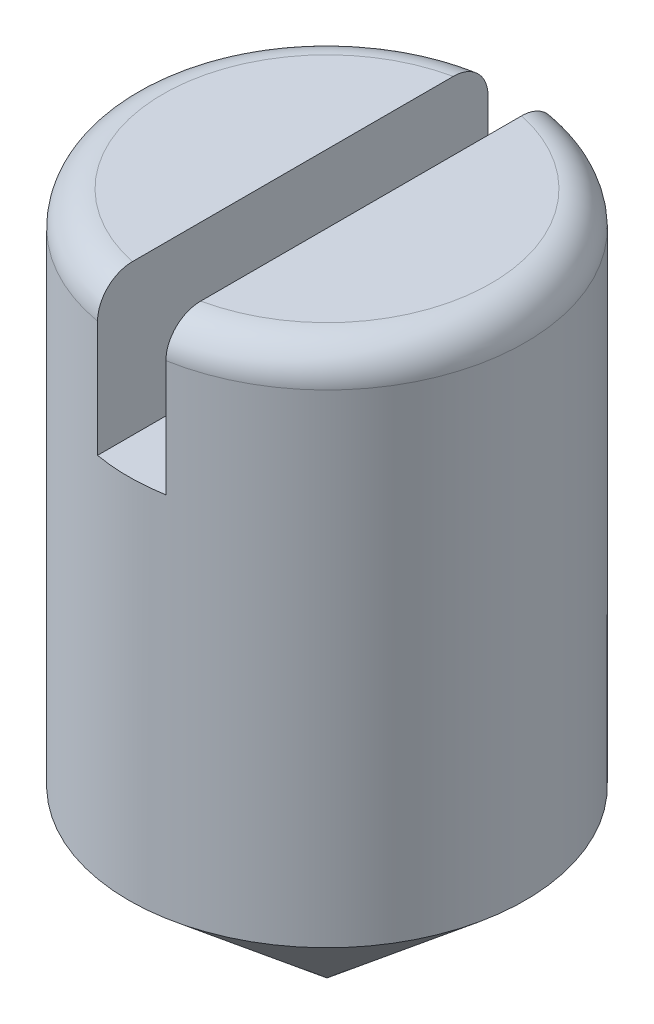
ISO-10303-21;
HEADER;
FILE_DESCRIPTION(('STEP AP214'),'2;1');
FILE_NAME('part.step','',(''),(''),'','','');
FILE_SCHEMA(('AUTOMOTIVE_DESIGN { 1 0 10303 214 1 1 1 1 }'));
ENDSEC;
DATA;
#1=APPLICATION_CONTEXT('core data for automotive mechanical design processes');
#2=APPLICATION_PROTOCOL_DEFINITION('international standard','automotive_design',2000,#1);
#3=PRODUCT_CONTEXT('',#1,'mechanical');
#4=PRODUCT('Part','Part','',(#3));
#5=PRODUCT_RELATED_PRODUCT_CATEGORY('part','',(#4));
#6=PRODUCT_DEFINITION_FORMATION('','',#4);
#7=PRODUCT_DEFINITION_CONTEXT('part definition',#1,'design');
#8=PRODUCT_DEFINITION('design','',#6,#7);
#9=PRODUCT_DEFINITION_SHAPE('','',#8);
#10=(LENGTH_UNIT() NAMED_UNIT(*) SI_UNIT(.MILLI.,.METRE.));
#11=(NAMED_UNIT(*) PLANE_ANGLE_UNIT() SI_UNIT($,.RADIAN.));
#12=(NAMED_UNIT(*) SI_UNIT($,.STERADIAN.) SOLID_ANGLE_UNIT());
#13=UNCERTAINTY_MEASURE_WITH_UNIT(LENGTH_MEASURE(1.E-05),#10,'distance_accuracy_value','');
#14=(GEOMETRIC_REPRESENTATION_CONTEXT(3) GLOBAL_UNCERTAINTY_ASSIGNED_CONTEXT((#13)) GLOBAL_UNIT_ASSIGNED_CONTEXT((#10,
#11,#12)) REPRESENTATION_CONTEXT('',''));
#15=CARTESIAN_POINT('',(0.,0.,0.));
#16=DIRECTION('',(0.,0.,1.));
#17=DIRECTION('',(1.,0.,0.));
#18=AXIS2_PLACEMENT_3D('',#15,#16,#17);
#19=CARTESIAN_POINT('',(0.,5.,0.));
#20=DIRECTION('',(0.,1.,0.));
#21=DIRECTION('',(0.,0.,1.));
#22=AXIS2_PLACEMENT_3D('',#19,#20,#21);
#23=PLANE('',#22);
#24=DIRECTION('',(0.,0.,1.));
#25=VECTOR('',#24,1.);
#26=CARTESIAN_POINT('',(-0.25,5.,-2.));
#27=LINE('',#26,#25);
#28=CARTESIAN_POINT('',(-0.25,5.,-1.17366945943055));
#29=VERTEX_POINT('',#28);
#30=CARTESIAN_POINT('',(-0.25,5.,1.17366945943055));
#31=VERTEX_POINT('',#30);
#32=EDGE_CURVE('E170',#29,#31,#27,.T.);
#33=ORIENTED_EDGE('',*,*,#32,.F.);
#34=CARTESIAN_POINT('',(0.,5.,0.));
#35=DIRECTION('',(0.,1.,0.));
#36=DIRECTION('',(0.,0.,1.));
#37=AXIS2_PLACEMENT_3D('',#34,#35,#36);
#38=CIRCLE('',#37,1.2);
#39=EDGE_CURVE('E11',#29,#31,#38,.T.);
#40=ORIENTED_EDGE('',*,*,#39,.T.);
#41=EDGE_LOOP('',(#33,#40));
#42=FACE_BOUND('',#41,.T.);
#43=ADVANCED_FACE('F32',(#42),#23,.T.);
#44=DIRECTION('',(0.,0.,1.));
#45=VECTOR('',#44,1.);
#46=CARTESIAN_POINT('',(0.25,5.,-2.));
#47=LINE('',#46,#45);
#48=CARTESIAN_POINT('',(0.25,5.,-1.17366945943055));
#49=VERTEX_POINT('',#48);
#50=CARTESIAN_POINT('',(0.25,5.,1.17366945943055));
#51=VERTEX_POINT('',#50);
#52=EDGE_CURVE('E164',#49,#51,#47,.T.);
#53=ORIENTED_EDGE('',*,*,#52,.T.);
#54=CARTESIAN_POINT('',(0.,5.,0.));
#55=DIRECTION('',(0.,1.,0.));
#56=DIRECTION('',(0.,0.,1.));
#57=AXIS2_PLACEMENT_3D('',#54,#55,#56);
#58=CIRCLE('',#57,1.2);
#59=EDGE_CURVE('E158',#51,#49,#58,.T.);
#60=ORIENTED_EDGE('',*,*,#59,.T.);
#61=EDGE_LOOP('',(#53,#60));
#62=FACE_BOUND('',#61,.T.);
#63=ADVANCED_FACE('F169',(#62),#23,.T.);
#64=CARTESIAN_POINT('',(0.,-16.3291243580724,0.));
#65=DIRECTION('',(0.,-1.,0.));
#66=DIRECTION('',(0.,0.,-1.));
#67=AXIS2_PLACEMENT_3D('',#64,#65,#66);
#68=CYLINDRICAL_SURFACE('',#67,1.45);
#69=DIRECTION('',(0.,-1.,0.));
#70=VECTOR('',#69,1.);
#71=CARTESIAN_POINT('',(0.250000000000004,-16.3291243580724,-1.42828568570857));
#72=LINE('',#71,#70);
#73=CARTESIAN_POINT('',(0.250000000000004,4.75,-1.42828568570857));
#74=VERTEX_POINT('',#73);
#75=CARTESIAN_POINT('',(0.25,3.9,-1.42828568570857));
#76=VERTEX_POINT('',#75);
#77=EDGE_CURVE('E97',#74,#76,#72,.T.);
#78=ORIENTED_EDGE('',*,*,#77,.F.);
#79=CARTESIAN_POINT('',(0.,4.75,0.));
#80=DIRECTION('',(0.,1.,0.));
#81=DIRECTION('',(0.,0.,1.));
#82=AXIS2_PLACEMENT_3D('',#79,#80,#81);
#83=CIRCLE('',#82,1.45);
#84=CARTESIAN_POINT('',(0.250000000000004,4.75,1.42828568570857));
#85=VERTEX_POINT('',#84);
#86=EDGE_CURVE('E119',#74,#85,#83,.F.);
#87=ORIENTED_EDGE('',*,*,#86,.T.);
#88=DIRECTION('',(0.,-1.,0.));
#89=VECTOR('',#88,1.);
#90=CARTESIAN_POINT('',(0.250000000000004,-16.3291243580724,1.42828568570857));
#91=LINE('',#90,#89);
#92=CARTESIAN_POINT('',(0.25,3.9,1.42828568570857));
#93=VERTEX_POINT('',#92);
#94=EDGE_CURVE('E112',#93,#85,#91,.F.);
#95=ORIENTED_EDGE('',*,*,#94,.F.);
#96=CARTESIAN_POINT('',(0.,3.9,0.));
#97=DIRECTION('',(0.,-1.,0.));
#98=DIRECTION('',(0.,0.,-1.));
#99=AXIS2_PLACEMENT_3D('',#96,#97,#98);
#100=CIRCLE('',#99,1.45);
#101=CARTESIAN_POINT('',(-0.25,3.9,1.42828568570857));
#102=VERTEX_POINT('',#101);
#103=EDGE_CURVE('E100',#102,#93,#100,.F.);
#104=ORIENTED_EDGE('',*,*,#103,.F.);
#105=DIRECTION('',(0.,-1.,0.));
#106=VECTOR('',#105,1.);
#107=CARTESIAN_POINT('',(-0.249999999999995,-16.3291243580724,1.42828568570857));
#108=LINE('',#107,#106);
#109=CARTESIAN_POINT('',(-0.249999999999995,4.75,1.42828568570857));
#110=VERTEX_POINT('',#109);
#111=EDGE_CURVE('E104',#110,#102,#108,.T.);
#112=ORIENTED_EDGE('',*,*,#111,.F.);
#113=CARTESIAN_POINT('',(0.,4.75,0.));
#114=DIRECTION('',(0.,1.,0.));
#115=DIRECTION('',(0.,0.,1.));
#116=AXIS2_PLACEMENT_3D('',#113,#114,#115);
#117=CIRCLE('',#116,1.45);
#118=CARTESIAN_POINT('',(-0.249999999999995,4.75,-1.42828568570857));
#119=VERTEX_POINT('',#118);
#120=EDGE_CURVE('E110',#110,#119,#117,.F.);
#121=ORIENTED_EDGE('',*,*,#120,.T.);
#122=DIRECTION('',(0.,-1.,0.));
#123=VECTOR('',#122,1.);
#124=CARTESIAN_POINT('',(-0.249999999999995,-16.3291243580724,-1.42828568570857));
#125=LINE('',#124,#123);
#126=CARTESIAN_POINT('',(-0.25,3.9,-1.42828568570857));
#127=VERTEX_POINT('',#126);
#128=EDGE_CURVE('E102',#127,#119,#125,.F.);
#129=ORIENTED_EDGE('',*,*,#128,.F.);
#130=EDGE_CURVE('E87',#76,#127,#100,.F.);
#131=ORIENTED_EDGE('',*,*,#130,.F.);
#132=EDGE_LOOP('',(#78,#87,#95,#104,#112,#121,#129,#131));
#133=FACE_BOUND('',#132,.T.);
#134=CARTESIAN_POINT('',(0.,1.21669446520704,0.));
#135=DIRECTION('',(0.,-1.,0.));
#136=DIRECTION('',(0.,0.,-1.));
#137=AXIS2_PLACEMENT_3D('',#134,#135,#136);
#138=CIRCLE('',#137,1.45);
#139=CARTESIAN_POINT('',(0.,1.21669446520704,-1.45));
#140=VERTEX_POINT('',#139);
#141=EDGE_CURVE('E98',#140,#140,#138,.T.);
#142=ORIENTED_EDGE('',*,*,#141,.F.);
#143=EDGE_LOOP('',(#142));
#144=FACE_BOUND('',#143,.T.);
#145=ADVANCED_FACE('F107',(#133,#144),#68,.T.);
#146=CARTESIAN_POINT('',(0.,0.,0.));
#147=DIRECTION('',(0.,1.,0.));
#148=DIRECTION('',(0.,0.,1.));
#149=AXIS2_PLACEMENT_3D('',#146,#147,#148);
#150=CONICAL_SURFACE('',#149,0.,0.87266462599717);
#151=ORIENTED_EDGE('',*,*,#141,.T.);
#152=EDGE_LOOP('',(#151));
#153=FACE_BOUND('',#152,.T.);
#154=CARTESIAN_POINT('',(0.,0.,0.));
#155=VERTEX_POINT('',#154);
#156=VERTEX_LOOP('',#155);
#157=FACE_BOUND('',#156,.T.);
#158=ADVANCED_FACE('F147',(#153,#157),#150,.T.);
#159=CARTESIAN_POINT('',(-0.25,5.,-2.));
#160=DIRECTION('',(-1.,0.,0.));
#161=DIRECTION('',(0.,-1.,0.));
#162=AXIS2_PLACEMENT_3D('',#159,#160,#161);
#163=PLANE('',#162);
#164=ORIENTED_EDGE('',*,*,#128,.T.);
#165=CARTESIAN_POINT('',(-0.249999999999995,4.75,-1.42828568570857));
#166=CARTESIAN_POINT('',(-0.249999999999998,4.76390396580057,-1.42829835922335));
#167=CARTESIAN_POINT('',(-0.25,4.77780332050058,-1.42710892606957));
#168=CARTESIAN_POINT('',(-0.250000000000001,4.80519096279249,-1.42242057893611));
#169=CARTESIAN_POINT('',(-0.25,4.81867970994686,-1.41892435426967));
#170=CARTESIAN_POINT('',(-0.25,4.84488311676052,-1.40971511442603));
#171=CARTESIAN_POINT('',(-0.25,4.85759749884517,-1.40400130969521));
#172=CARTESIAN_POINT('',(-0.25,4.88189295280145,-1.39053355219744));
#173=CARTESIAN_POINT('',(-0.25,4.89347410661745,-1.38277974709388));
#174=CARTESIAN_POINT('',(-0.25,4.91525299770735,-1.36540947638875));
#175=CARTESIAN_POINT('',(-0.25,4.92544233307303,-1.35578248162471));
#176=CARTESIAN_POINT('',(-0.25,4.94408921880547,-1.33497453266207));
#177=CARTESIAN_POINT('',(-0.25,4.95254643476625,-1.32379327909371));
#178=CARTESIAN_POINT('',(-0.25,4.96762080479673,-1.30002524495586));
#179=CARTESIAN_POINT('',(-0.25,4.9742094793508,-1.28742042448129));
#180=CARTESIAN_POINT('',(-0.25,4.98521718046856,-1.26129795388939));
#181=CARTESIAN_POINT('',(-0.25,4.98963678430935,-1.2477805477385));
#182=CARTESIAN_POINT('',(-0.25,4.99527630515981,-1.22411985675256));
#183=CARTESIAN_POINT('',(-0.25,4.99704774333302,-1.21410411626585));
#184=CARTESIAN_POINT('',(-0.25,4.99940953596686,-1.19394971862947));
#185=CARTESIAN_POINT('',(-0.25,5.00000168178337,-1.18381127147977));
#186=CARTESIAN_POINT('',(-0.25,5.,-1.17366945943055));
#187=B_SPLINE_CURVE_WITH_KNOTS('',3,(#165,#166,#167,#168,#169,#170,#171,#172,#173,#174,#175,
#176,#177,#178,#179,#180,#181,#182,#183,#184,#185,#186),.UNSPECIFIED.,.F.,.F.,(4,2,2,2,2,2,2,2,
2,2,4),(0.,0.0416543048654862,0.0832601337402661,0.124880789684343,0.166498433787279,
0.208357144934136,0.250223929794697,0.292698194366415,0.335161148687114,0.365608823320661,
0.396010212274151),.UNSPECIFIED.);
#188=EDGE_CURVE('E41',#119,#29,#187,.T.);
#189=ORIENTED_EDGE('',*,*,#188,.T.);
#190=ORIENTED_EDGE('',*,*,#32,.T.);
#191=CARTESIAN_POINT('',(-0.25,5.,1.17366945943055));
#192=CARTESIAN_POINT('',(-0.25,5.00001155193243,1.18820940210991));
#193=CARTESIAN_POINT('',(-0.25,4.99878719156247,1.20274917450408));
#194=CARTESIAN_POINT('',(-0.25,4.99393614602383,1.23142160116774));
#195=CARTESIAN_POINT('',(-0.25,4.99030957321328,1.24555427444613));
#196=CARTESIAN_POINT('',(-0.25,4.98071948766607,1.27301891183353));
#197=CARTESIAN_POINT('',(-0.25,4.97475397705525,1.28635018014071));
#198=CARTESIAN_POINT('',(-0.25,4.96064371634686,1.31179883139182));
#199=CARTESIAN_POINT('',(-0.25,4.95249988429679,1.32391672276004));
#200=CARTESIAN_POINT('',(-0.25,4.93436849541597,1.34642979412237));
#201=CARTESIAN_POINT('',(-0.25,4.92440580382619,1.35684499210711));
#202=CARTESIAN_POINT('',(-0.25,4.90284259908084,1.37582109109584));
#203=CARTESIAN_POINT('',(-0.25,4.89124179710885,1.38438166443367));
#204=CARTESIAN_POINT('',(-0.25,4.86695247007143,1.39924666708497));
#205=CARTESIAN_POINT('',(-0.25,4.85428620941432,1.40558753241447));
#206=CARTESIAN_POINT('',(-0.25,4.82806300798305,1.41601669635558));
#207=CARTESIAN_POINT('',(-0.25,4.81450680678249,1.42010683952812));
#208=CARTESIAN_POINT('',(-0.25,4.79237275383114,1.42476331535927));
#209=CARTESIAN_POINT('',(-0.25,4.7839462928766,1.42608352700669));
#210=CARTESIAN_POINT('',(-0.25,4.76701452066704,1.4278444383706));
#211=CARTESIAN_POINT('',(-0.25,4.75850934355432,1.42828642831631));
#212=CARTESIAN_POINT('',(-0.25,4.75000000000014,1.42828568570923));
#213=B_SPLINE_CURVE_WITH_KNOTS('',3,(#191,#192,#193,#194,#195,#196,#197,#198,#199,#200,#201,
#202,#203,#204,#205,#206,#207,#208,#209,#210,#211,#212),.UNSPECIFIED.,.F.,.F.,(4,2,2,2,2,2,2,2,
2,2,4),(0.,0.0435684497895158,0.0871348619058745,0.130738568944122,0.174323928197449,
0.217352854576829,0.260389376911784,0.302682095957818,0.344940102534478,0.370486070773254,
0.395994480617803),.UNSPECIFIED.);
#214=EDGE_CURVE('E151',#31,#110,#213,.T.);
#215=ORIENTED_EDGE('',*,*,#214,.T.);
#216=ORIENTED_EDGE('',*,*,#111,.T.);
#217=DIRECTION('',(0.,0.,1.));
#218=VECTOR('',#217,1.);
#219=CARTESIAN_POINT('',(-0.25,3.9,-2.));
#220=LINE('',#219,#218);
#221=EDGE_CURVE('E90',#127,#102,#220,.T.);
#222=ORIENTED_EDGE('',*,*,#221,.F.);
#223=EDGE_LOOP('',(#164,#189,#190,#215,#216,#222));
#224=FACE_BOUND('',#223,.T.);
#225=ADVANCED_FACE('F101',(#224),#163,.F.);
#226=CARTESIAN_POINT('',(0.25,5.,-2.));
#227=DIRECTION('',(1.,0.,0.));
#228=DIRECTION('',(0.,1.,0.));
#229=AXIS2_PLACEMENT_3D('',#226,#227,#228);
#230=PLANE('',#229);
#231=ORIENTED_EDGE('',*,*,#94,.T.);
#232=CARTESIAN_POINT('',(0.250000000000004,4.75,1.42828568570857));
#233=CARTESIAN_POINT('',(0.250000000000001,4.76390396580057,1.42829835922335));
#234=CARTESIAN_POINT('',(0.25,4.77780332050058,1.42710892606957));
#235=CARTESIAN_POINT('',(0.25,4.80519096279249,1.42242057893611));
#236=CARTESIAN_POINT('',(0.25,4.81867970994686,1.41892435426967));
#237=CARTESIAN_POINT('',(0.25,4.84488311676052,1.40971511442603));
#238=CARTESIAN_POINT('',(0.25,4.85759749884517,1.40400130969521));
#239=CARTESIAN_POINT('',(0.25,4.88189295280144,1.39053355219744));
#240=CARTESIAN_POINT('',(0.25,4.89347410661745,1.38277974709388));
#241=CARTESIAN_POINT('',(0.25,4.91525299770735,1.36540947638875));
#242=CARTESIAN_POINT('',(0.25,4.92544233307303,1.35578248162471));
#243=CARTESIAN_POINT('',(0.25,4.94408921880547,1.33497453266207));
#244=CARTESIAN_POINT('',(0.25,4.95254643476625,1.32379327909371));
#245=CARTESIAN_POINT('',(0.25,4.96762080479673,1.30002524495586));
#246=CARTESIAN_POINT('',(0.25,4.9742094793508,1.28742042448129));
#247=CARTESIAN_POINT('',(0.25,4.98521718046856,1.26129795388939));
#248=CARTESIAN_POINT('',(0.25,4.98963678430935,1.2477805477385));
#249=CARTESIAN_POINT('',(0.25,4.99527630515981,1.22411985675256));
#250=CARTESIAN_POINT('',(0.25,4.99704774333302,1.21410411626585));
#251=CARTESIAN_POINT('',(0.25,4.99940953596686,1.19394971862947));
#252=CARTESIAN_POINT('',(0.25,5.00000168178337,1.18381127147977));
#253=CARTESIAN_POINT('',(0.25,5.,1.17366945943055));
#254=B_SPLINE_CURVE_WITH_KNOTS('',3,(#232,#233,#234,#235,#236,#237,#238,#239,#240,#241,#242,
#243,#244,#245,#246,#247,#248,#249,#250,#251,#252,#253),.UNSPECIFIED.,.F.,.F.,(4,2,2,2,2,2,2,2,
2,2,4),(0.,0.041654304865486,0.083260133740266,0.124880789684342,0.166498433787279,
0.208357144934135,0.250223929794697,0.292698194366415,0.335161148687114,0.365608823320661,
0.396010212274151),.UNSPECIFIED.);
#255=EDGE_CURVE('E128',#85,#51,#254,.T.);
#256=ORIENTED_EDGE('',*,*,#255,.T.);
#257=ORIENTED_EDGE('',*,*,#52,.F.);
#258=CARTESIAN_POINT('',(0.25,5.,-1.17366945943055));
#259=CARTESIAN_POINT('',(0.25,5.00001155193243,-1.18820940210991));
#260=CARTESIAN_POINT('',(0.25,4.99878719156247,-1.20274917450408));
#261=CARTESIAN_POINT('',(0.25,4.99393614602383,-1.23142160116774));
#262=CARTESIAN_POINT('',(0.25,4.99030957321328,-1.24555427444613));
#263=CARTESIAN_POINT('',(0.25,4.98071948766607,-1.27301891183353));
#264=CARTESIAN_POINT('',(0.25,4.97475397705525,-1.28635018014071));
#265=CARTESIAN_POINT('',(0.25,4.96064371634686,-1.31179883139182));
#266=CARTESIAN_POINT('',(0.25,4.95249988429679,-1.32391672276004));
#267=CARTESIAN_POINT('',(0.25,4.93436849541597,-1.34642979412237));
#268=CARTESIAN_POINT('',(0.25,4.92440580382619,-1.35684499210711));
#269=CARTESIAN_POINT('',(0.25,4.90284259908084,-1.37582109109584));
#270=CARTESIAN_POINT('',(0.25,4.89124179710885,-1.38438166443367));
#271=CARTESIAN_POINT('',(0.25,4.86695247007143,-1.39924666708497));
#272=CARTESIAN_POINT('',(0.25,4.85428620941432,-1.40558753241447));
#273=CARTESIAN_POINT('',(0.25,4.82806300798305,-1.41601669635558));
#274=CARTESIAN_POINT('',(0.25,4.81450680678249,-1.42010683952812));
#275=CARTESIAN_POINT('',(0.25,4.79237275383114,-1.42476331535927));
#276=CARTESIAN_POINT('',(0.25,4.7839462928766,-1.42608352700669));
#277=CARTESIAN_POINT('',(0.25,4.76701452066704,-1.4278444383706));
#278=CARTESIAN_POINT('',(0.25,4.75850934355432,-1.42828642831631));
#279=CARTESIAN_POINT('',(0.25,4.75000000000014,-1.42828568570923));
#280=B_SPLINE_CURVE_WITH_KNOTS('',3,(#258,#259,#260,#261,#262,#263,#264,#265,#266,#267,#268,
#269,#270,#271,#272,#273,#274,#275,#276,#277,#278,#279),.UNSPECIFIED.,.F.,.F.,(4,2,2,2,2,2,2,2,
2,2,4),(0.,0.0435684497895158,0.0871348619058745,0.130738568944122,0.174323928197449,
0.217352854576829,0.260389376911784,0.302682095957818,0.344940102534478,0.370486070773254,
0.395994480617803),.UNSPECIFIED.);
#281=EDGE_CURVE('E122',#49,#74,#280,.T.);
#282=ORIENTED_EDGE('',*,*,#281,.T.);
#283=ORIENTED_EDGE('',*,*,#77,.T.);
#284=DIRECTION('',(0.,0.,1.));
#285=VECTOR('',#284,1.);
#286=CARTESIAN_POINT('',(0.25,3.9,-2.));
#287=LINE('',#286,#285);
#288=EDGE_CURVE('E93',#76,#93,#287,.T.);
#289=ORIENTED_EDGE('',*,*,#288,.T.);
#290=EDGE_LOOP('',(#231,#256,#257,#282,#283,#289));
#291=FACE_BOUND('',#290,.T.);
#292=ADVANCED_FACE('F136',(#291),#230,.F.);
#293=CARTESIAN_POINT('',(-0.25,3.9,-2.));
#294=DIRECTION('',(0.,-1.,0.));
#295=DIRECTION('',(0.,0.,-1.));
#296=AXIS2_PLACEMENT_3D('',#293,#294,#295);
#297=PLANE('',#296);
#298=ORIENTED_EDGE('',*,*,#103,.T.);
#299=ORIENTED_EDGE('',*,*,#288,.F.);
#300=ORIENTED_EDGE('',*,*,#130,.T.);
#301=ORIENTED_EDGE('',*,*,#221,.T.);
#302=EDGE_LOOP('',(#298,#299,#300,#301));
#303=FACE_BOUND('',#302,.T.);
#304=ADVANCED_FACE('F89',(#303),#297,.F.);
#305=CARTESIAN_POINT('',(0.,4.75,0.));
#306=DIRECTION('',(0.,1.,0.));
#307=DIRECTION('',(0.,0.,1.));
#308=AXIS2_PLACEMENT_3D('',#305,#306,#307);
#309=TOROIDAL_SURFACE('',#308,1.2,0.25);
#310=ORIENTED_EDGE('',*,*,#281,.F.);
#311=ORIENTED_EDGE('',*,*,#59,.F.);
#312=ORIENTED_EDGE('',*,*,#255,.F.);
#313=ORIENTED_EDGE('',*,*,#86,.F.);
#314=EDGE_LOOP('',(#310,#311,#312,#313));
#315=FACE_BOUND('',#314,.T.);
#316=ADVANCED_FACE('F133',(#315),#309,.T.);
#317=CARTESIAN_POINT('',(0.,4.75,0.));
#318=DIRECTION('',(0.,1.,0.));
#319=DIRECTION('',(0.,0.,1.));
#320=AXIS2_PLACEMENT_3D('',#317,#318,#319);
#321=TOROIDAL_SURFACE('',#320,1.2,0.25);
#322=ORIENTED_EDGE('',*,*,#214,.F.);
#323=ORIENTED_EDGE('',*,*,#39,.F.);
#324=ORIENTED_EDGE('',*,*,#188,.F.);
#325=ORIENTED_EDGE('',*,*,#120,.F.);
#326=EDGE_LOOP('',(#322,#323,#324,#325));
#327=FACE_BOUND('',#326,.T.);
#328=ADVANCED_FACE('F34',(#327),#321,.T.);
#329=CLOSED_SHELL('',(#43,#63,#145,#158,#225,#292,#304,#316,#328));
#330=MANIFOLD_SOLID_BREP('B2',#329);
#331=ADVANCED_BREP_SHAPE_REPRESENTATION('',(#18,#330),#14);
#332=SHAPE_DEFINITION_REPRESENTATION(#9,#331);
ENDSEC;
END-ISO-10303-21;
